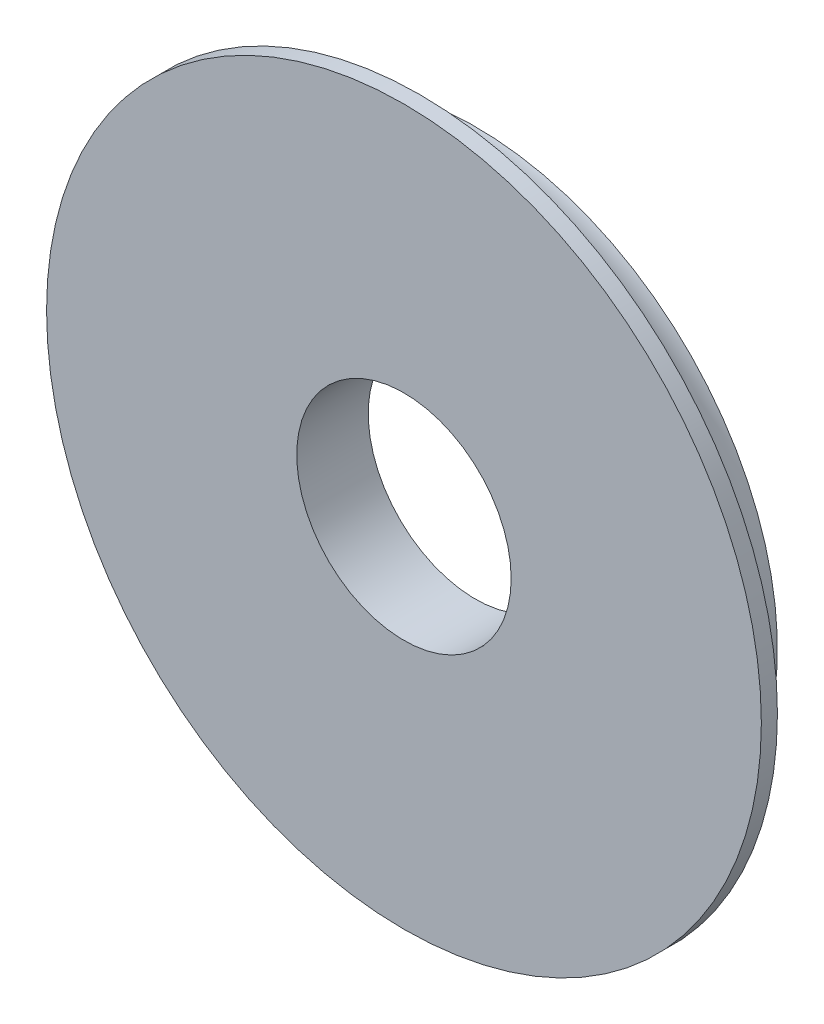
ISO-10303-21;
HEADER;
FILE_DESCRIPTION(('STEP AP214'),'2;1');
FILE_NAME('part.step','',(''),(''),'','','');
FILE_SCHEMA(('AUTOMOTIVE_DESIGN { 1 0 10303 214 1 1 1 1 }'));
ENDSEC;
DATA;
#1=APPLICATION_CONTEXT('core data for automotive mechanical design processes');
#2=APPLICATION_PROTOCOL_DEFINITION('international standard','automotive_design',2000,#1);
#3=PRODUCT_CONTEXT('',#1,'mechanical');
#4=PRODUCT('Part','Part','',(#3));
#5=PRODUCT_RELATED_PRODUCT_CATEGORY('part','',(#4));
#6=PRODUCT_DEFINITION_FORMATION('','',#4);
#7=PRODUCT_DEFINITION_CONTEXT('part definition',#1,'design');
#8=PRODUCT_DEFINITION('design','',#6,#7);
#9=PRODUCT_DEFINITION_SHAPE('','',#8);
#10=(LENGTH_UNIT() NAMED_UNIT(*) SI_UNIT(.MILLI.,.METRE.));
#11=(NAMED_UNIT(*) PLANE_ANGLE_UNIT() SI_UNIT($,.RADIAN.));
#12=(NAMED_UNIT(*) SI_UNIT($,.STERADIAN.) SOLID_ANGLE_UNIT());
#13=UNCERTAINTY_MEASURE_WITH_UNIT(LENGTH_MEASURE(1.E-05),#10,'distance_accuracy_value','');
#14=(GEOMETRIC_REPRESENTATION_CONTEXT(3) GLOBAL_UNCERTAINTY_ASSIGNED_CONTEXT((#13)) GLOBAL_UNIT_ASSIGNED_CONTEXT((#10,
#11,#12)) REPRESENTATION_CONTEXT('',''));
#15=CARTESIAN_POINT('',(0.,0.,0.));
#16=DIRECTION('',(0.,0.,1.));
#17=DIRECTION('',(1.,0.,0.));
#18=AXIS2_PLACEMENT_3D('',#15,#16,#17);
#19=CARTESIAN_POINT('',(0.,0.,0.));
#20=DIRECTION('',(0.,0.,1.));
#21=DIRECTION('',(1.,0.,0.));
#22=AXIS2_PLACEMENT_3D('',#19,#20,#21);
#23=PLANE('',#22);
#24=CARTESIAN_POINT('',(0.,0.,0.));
#25=DIRECTION('',(0.,0.,1.));
#26=DIRECTION('',(1.,0.,0.));
#27=AXIS2_PLACEMENT_3D('',#24,#25,#26);
#28=CIRCLE('',#27,3.);
#29=CARTESIAN_POINT('',(3.,0.,0.));
#30=VERTEX_POINT('',#29);
#31=EDGE_CURVE('E45',#30,#30,#28,.T.);
#32=ORIENTED_EDGE('',*,*,#31,.T.);
#33=EDGE_LOOP('',(#32));
#34=FACE_BOUND('',#33,.T.);
#35=CARTESIAN_POINT('',(0.,0.,0.));
#36=DIRECTION('',(0.,0.,-1.));
#37=DIRECTION('',(-1.,0.,0.));
#38=AXIS2_PLACEMENT_3D('',#35,#36,#37);
#39=CIRCLE('',#38,8.45);
#40=CARTESIAN_POINT('',(-8.45,0.,0.));
#41=VERTEX_POINT('',#40);
#42=EDGE_CURVE('E49',#41,#41,#39,.T.);
#43=ORIENTED_EDGE('',*,*,#42,.T.);
#44=EDGE_LOOP('',(#43));
#45=FACE_BOUND('',#44,.T.);
#46=ADVANCED_FACE('F33',(#34,#45),#23,.F.);
#47=CARTESIAN_POINT('',(0.,0.,2.));
#48=DIRECTION('',(0.,0.,1.));
#49=DIRECTION('',(1.,0.,0.));
#50=AXIS2_PLACEMENT_3D('',#47,#48,#49);
#51=PLANE('',#50);
#52=CARTESIAN_POINT('',(0.,0.,2.));
#53=DIRECTION('',(0.,0.,1.));
#54=DIRECTION('',(1.,0.,0.));
#55=AXIS2_PLACEMENT_3D('',#52,#53,#54);
#56=CIRCLE('',#55,10.);
#57=CARTESIAN_POINT('',(10.,0.,2.));
#58=VERTEX_POINT('',#57);
#59=EDGE_CURVE('E10',#58,#58,#56,.T.);
#60=ORIENTED_EDGE('',*,*,#59,.T.);
#61=EDGE_LOOP('',(#60));
#62=FACE_BOUND('',#61,.T.);
#63=CARTESIAN_POINT('',(0.,0.,2.));
#64=DIRECTION('',(0.,0.,1.));
#65=DIRECTION('',(1.,0.,0.));
#66=AXIS2_PLACEMENT_3D('',#63,#64,#65);
#67=CIRCLE('',#66,3.);
#68=CARTESIAN_POINT('',(3.,0.,2.));
#69=VERTEX_POINT('',#68);
#70=EDGE_CURVE('E41',#69,#69,#67,.T.);
#71=ORIENTED_EDGE('',*,*,#70,.F.);
#72=EDGE_LOOP('',(#71));
#73=FACE_BOUND('',#72,.T.);
#74=ADVANCED_FACE('F70',(#62,#73),#51,.T.);
#75=CARTESIAN_POINT('',(0.,0.,2.));
#76=DIRECTION('',(0.,0.,-1.));
#77=DIRECTION('',(-1.,0.,0.));
#78=AXIS2_PLACEMENT_3D('',#75,#76,#77);
#79=CYLINDRICAL_SURFACE('',#78,10.);
#80=CARTESIAN_POINT('',(0.,0.,1.55));
#81=DIRECTION('',(0.,0.,-1.));
#82=DIRECTION('',(-1.,0.,0.));
#83=AXIS2_PLACEMENT_3D('',#80,#81,#82);
#84=CIRCLE('',#83,10.);
#85=CARTESIAN_POINT('',(-10.,0.,1.55));
#86=VERTEX_POINT('',#85);
#87=EDGE_CURVE('E37',#86,#86,#84,.F.);
#88=ORIENTED_EDGE('',*,*,#87,.T.);
#89=EDGE_LOOP('',(#88));
#90=FACE_BOUND('',#89,.T.);
#91=ORIENTED_EDGE('',*,*,#59,.F.);
#92=EDGE_LOOP('',(#91));
#93=FACE_BOUND('',#92,.T.);
#94=ADVANCED_FACE('F35',(#90,#93),#79,.T.);
#95=CARTESIAN_POINT('',(0.,0.,2.));
#96=DIRECTION('',(0.,0.,-1.));
#97=DIRECTION('',(-1.,0.,0.));
#98=AXIS2_PLACEMENT_3D('',#95,#96,#97);
#99=CYLINDRICAL_SURFACE('',#98,3.);
#100=ORIENTED_EDGE('',*,*,#70,.T.);
#101=EDGE_LOOP('',(#100));
#102=FACE_BOUND('',#101,.T.);
#103=ORIENTED_EDGE('',*,*,#31,.F.);
#104=EDGE_LOOP('',(#103));
#105=FACE_BOUND('',#104,.T.);
#106=ADVANCED_FACE('F62',(#102,#105),#99,.F.);
#107=CARTESIAN_POINT('',(0.,0.,0.));
#108=DIRECTION('',(0.,0.,1.));
#109=DIRECTION('',(1.,0.,0.));
#110=AXIS2_PLACEMENT_3D('',#107,#108,#109);
#111=TOROIDAL_SURFACE('',#110,10.,1.55);
#112=ORIENTED_EDGE('',*,*,#87,.F.);
#113=EDGE_LOOP('',(#112));
#114=FACE_BOUND('',#113,.T.);
#115=ORIENTED_EDGE('',*,*,#42,.F.);
#116=EDGE_LOOP('',(#115));
#117=FACE_BOUND('',#116,.T.);
#118=ADVANCED_FACE('F59',(#114,#117),#111,.F.);
#119=CLOSED_SHELL('',(#46,#74,#94,#106,#118));
#120=MANIFOLD_SOLID_BREP('B2',#119);
#121=ADVANCED_BREP_SHAPE_REPRESENTATION('',(#18,#120),#14);
#122=SHAPE_DEFINITION_REPRESENTATION(#9,#121);
ENDSEC;
END-ISO-10303-21;
